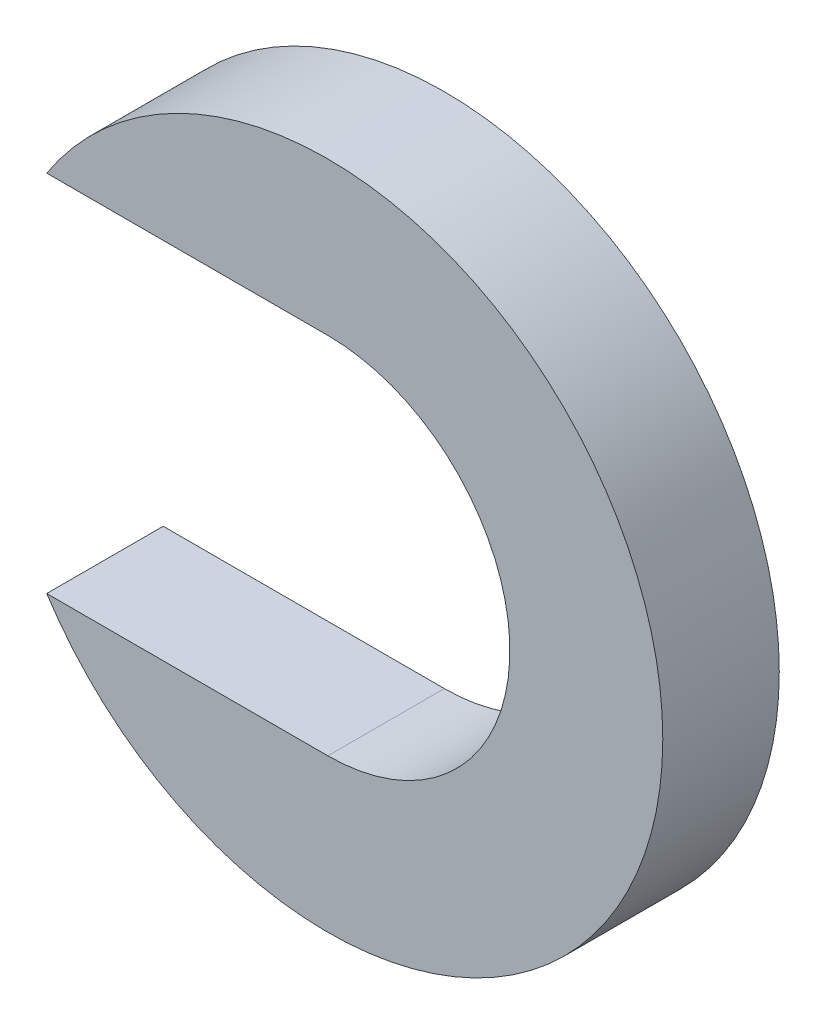
ISO-10303-21;
HEADER;
FILE_DESCRIPTION(('STEP AP214'),'2;1');
FILE_NAME('part.step','',(''),(''),'','','');
FILE_SCHEMA(('AUTOMOTIVE_DESIGN { 1 0 10303 214 1 1 1 1 }'));
ENDSEC;
DATA;
#1=APPLICATION_CONTEXT('core data for automotive mechanical design processes');
#2=APPLICATION_PROTOCOL_DEFINITION('international standard','automotive_design',2000,#1);
#3=PRODUCT_CONTEXT('',#1,'mechanical');
#4=PRODUCT('Part','Part','',(#3));
#5=PRODUCT_RELATED_PRODUCT_CATEGORY('part','',(#4));
#6=PRODUCT_DEFINITION_FORMATION('','',#4);
#7=PRODUCT_DEFINITION_CONTEXT('part definition',#1,'design');
#8=PRODUCT_DEFINITION('design','',#6,#7);
#9=PRODUCT_DEFINITION_SHAPE('','',#8);
#10=(LENGTH_UNIT() NAMED_UNIT(*) SI_UNIT(.MILLI.,.METRE.));
#11=(NAMED_UNIT(*) PLANE_ANGLE_UNIT() SI_UNIT($,.RADIAN.));
#12=(NAMED_UNIT(*) SI_UNIT($,.STERADIAN.) SOLID_ANGLE_UNIT());
#13=UNCERTAINTY_MEASURE_WITH_UNIT(LENGTH_MEASURE(1.E-05),#10,'distance_accuracy_value','');
#14=(GEOMETRIC_REPRESENTATION_CONTEXT(3) GLOBAL_UNCERTAINTY_ASSIGNED_CONTEXT((#13)) GLOBAL_UNIT_ASSIGNED_CONTEXT((#10,
#11,#12)) REPRESENTATION_CONTEXT('',''));
#15=CARTESIAN_POINT('',(0.,0.,0.));
#16=DIRECTION('',(0.,0.,1.));
#17=DIRECTION('',(1.,0.,0.));
#18=AXIS2_PLACEMENT_3D('',#15,#16,#17);
#19=CARTESIAN_POINT('',(0.,0.,3.175));
#20=DIRECTION('',(0.,0.,-1.));
#21=DIRECTION('',(-1.,0.,0.));
#22=AXIS2_PLACEMENT_3D('',#19,#20,#21);
#23=CYLINDRICAL_SURFACE('',#22,9.128125);
#24=CARTESIAN_POINT('',(0.,0.,0.));
#25=DIRECTION('',(0.,0.,1.));
#26=DIRECTION('',(1.,0.,0.));
#27=AXIS2_PLACEMENT_3D('',#24,#25,#26);
#28=CIRCLE('',#27,9.128125);
#29=CARTESIAN_POINT('',(-7.66236028497217,-4.9609375,0.));
#30=VERTEX_POINT('',#29);
#31=CARTESIAN_POINT('',(-7.66236028497217,4.9609375,0.));
#32=VERTEX_POINT('',#31);
#33=EDGE_CURVE('E95',#30,#32,#28,.T.);
#34=ORIENTED_EDGE('',*,*,#33,.T.);
#35=DIRECTION('',(0.,0.,-1.));
#36=VECTOR('',#35,1.);
#37=CARTESIAN_POINT('',(-7.66236028497217,4.9609375,3.175));
#38=LINE('',#37,#36);
#39=CARTESIAN_POINT('',(-7.66236028497217,4.9609375,3.175));
#40=VERTEX_POINT('',#39);
#41=EDGE_CURVE('E11',#40,#32,#38,.T.);
#42=ORIENTED_EDGE('',*,*,#41,.F.);
#43=CARTESIAN_POINT('',(0.,0.,3.175));
#44=DIRECTION('',(0.,0.,1.));
#45=DIRECTION('',(1.,0.,0.));
#46=AXIS2_PLACEMENT_3D('',#43,#44,#45);
#47=CIRCLE('',#46,9.128125);
#48=CARTESIAN_POINT('',(-7.66236028497217,-4.9609375,3.175));
#49=VERTEX_POINT('',#48);
#50=EDGE_CURVE('E83',#49,#40,#47,.T.);
#51=ORIENTED_EDGE('',*,*,#50,.F.);
#52=DIRECTION('',(0.,0.,-1.));
#53=VECTOR('',#52,1.);
#54=CARTESIAN_POINT('',(-7.66236028497217,-4.9609375,3.175));
#55=LINE('',#54,#53);
#56=EDGE_CURVE('E91',#49,#30,#55,.T.);
#57=ORIENTED_EDGE('',*,*,#56,.T.);
#58=EDGE_LOOP('',(#34,#42,#51,#57));
#59=FACE_BOUND('',#58,.T.);
#60=ADVANCED_FACE('F32',(#59),#23,.T.);
#61=CARTESIAN_POINT('',(0.,4.9609375,3.175));
#62=DIRECTION('',(0.,1.,0.));
#63=DIRECTION('',(0.,0.,1.));
#64=AXIS2_PLACEMENT_3D('',#61,#62,#63);
#65=PLANE('',#64);
#66=DIRECTION('',(1.,0.,0.));
#67=VECTOR('',#66,1.);
#68=CARTESIAN_POINT('',(0.,4.9609375,0.));
#69=LINE('',#68,#67);
#70=CARTESIAN_POINT('',(0.,4.9609375,0.));
#71=VERTEX_POINT('',#70);
#72=EDGE_CURVE('E87',#32,#71,#69,.T.);
#73=ORIENTED_EDGE('',*,*,#72,.T.);
#74=DIRECTION('',(0.,0.,-1.));
#75=VECTOR('',#74,1.);
#76=CARTESIAN_POINT('',(0.,4.9609375,3.175));
#77=LINE('',#76,#75);
#78=CARTESIAN_POINT('',(0.,4.9609375,3.175));
#79=VERTEX_POINT('',#78);
#80=EDGE_CURVE('E40',#79,#71,#77,.T.);
#81=ORIENTED_EDGE('',*,*,#80,.F.);
#82=DIRECTION('',(1.,0.,0.));
#83=VECTOR('',#82,1.);
#84=CARTESIAN_POINT('',(0.,4.9609375,3.175));
#85=LINE('',#84,#83);
#86=EDGE_CURVE('E78',#40,#79,#85,.T.);
#87=ORIENTED_EDGE('',*,*,#86,.F.);
#88=ORIENTED_EDGE('',*,*,#41,.T.);
#89=EDGE_LOOP('',(#73,#81,#87,#88));
#90=FACE_BOUND('',#89,.T.);
#91=ADVANCED_FACE('F86',(#90),#65,.F.);
#92=CARTESIAN_POINT('',(0.,0.,3.175));
#93=DIRECTION('',(0.,0.,-1.));
#94=DIRECTION('',(-1.,0.,0.));
#95=AXIS2_PLACEMENT_3D('',#92,#93,#94);
#96=CYLINDRICAL_SURFACE('',#95,4.9609375);
#97=CARTESIAN_POINT('',(0.,0.,0.));
#98=DIRECTION('',(0.,0.,-1.));
#99=DIRECTION('',(1.,0.,0.));
#100=AXIS2_PLACEMENT_3D('',#97,#98,#99);
#101=CIRCLE('',#100,4.9609375);
#102=CARTESIAN_POINT('',(0.,-4.9609375,0.));
#103=VERTEX_POINT('',#102);
#104=EDGE_CURVE('E65',#71,#103,#101,.T.);
#105=ORIENTED_EDGE('',*,*,#104,.T.);
#106=DIRECTION('',(0.,0.,-1.));
#107=VECTOR('',#106,1.);
#108=CARTESIAN_POINT('',(0.,-4.9609375,3.175));
#109=LINE('',#108,#107);
#110=CARTESIAN_POINT('',(0.,-4.9609375,3.175));
#111=VERTEX_POINT('',#110);
#112=EDGE_CURVE('E88',#111,#103,#109,.T.);
#113=ORIENTED_EDGE('',*,*,#112,.F.);
#114=CARTESIAN_POINT('',(0.,0.,3.175));
#115=DIRECTION('',(0.,0.,-1.));
#116=DIRECTION('',(1.,0.,0.));
#117=AXIS2_PLACEMENT_3D('',#114,#115,#116);
#118=CIRCLE('',#117,4.9609375);
#119=EDGE_CURVE('E81',#79,#111,#118,.T.);
#120=ORIENTED_EDGE('',*,*,#119,.F.);
#121=ORIENTED_EDGE('',*,*,#80,.T.);
#122=EDGE_LOOP('',(#105,#113,#120,#121));
#123=FACE_BOUND('',#122,.T.);
#124=ADVANCED_FACE('F89',(#123),#96,.F.);
#125=CARTESIAN_POINT('',(-7.66236028497217,-4.9609375,3.175));
#126=DIRECTION('',(0.,-1.,0.));
#127=DIRECTION('',(1.,0.,0.));
#128=AXIS2_PLACEMENT_3D('',#125,#126,#127);
#129=PLANE('',#128);
#130=DIRECTION('',(-1.,0.,0.));
#131=VECTOR('',#130,1.);
#132=CARTESIAN_POINT('',(-7.66236028497217,-4.9609375,0.));
#133=LINE('',#132,#131);
#134=EDGE_CURVE('E71',#103,#30,#133,.T.);
#135=ORIENTED_EDGE('',*,*,#134,.T.);
#136=ORIENTED_EDGE('',*,*,#56,.F.);
#137=DIRECTION('',(-1.,0.,0.));
#138=VECTOR('',#137,1.);
#139=CARTESIAN_POINT('',(-7.66236028497217,-4.9609375,3.175));
#140=LINE('',#139,#138);
#141=EDGE_CURVE('E48',#111,#49,#140,.T.);
#142=ORIENTED_EDGE('',*,*,#141,.F.);
#143=ORIENTED_EDGE('',*,*,#112,.T.);
#144=EDGE_LOOP('',(#135,#136,#142,#143));
#145=FACE_BOUND('',#144,.T.);
#146=ADVANCED_FACE('F102',(#145),#129,.F.);
#147=CARTESIAN_POINT('',(0.,0.,3.175));
#148=DIRECTION('',(0.,0.,1.));
#149=DIRECTION('',(1.,0.,0.));
#150=AXIS2_PLACEMENT_3D('',#147,#148,#149);
#151=PLANE('',#150);
#152=ORIENTED_EDGE('',*,*,#50,.T.);
#153=ORIENTED_EDGE('',*,*,#86,.T.);
#154=ORIENTED_EDGE('',*,*,#119,.T.);
#155=ORIENTED_EDGE('',*,*,#141,.T.);
#156=EDGE_LOOP('',(#152,#153,#154,#155));
#157=FACE_BOUND('',#156,.T.);
#158=ADVANCED_FACE('F79',(#157),#151,.T.);
#159=CARTESIAN_POINT('',(0.,0.,0.));
#160=DIRECTION('',(0.,0.,1.));
#161=DIRECTION('',(1.,0.,0.));
#162=AXIS2_PLACEMENT_3D('',#159,#160,#161);
#163=PLANE('',#162);
#164=ORIENTED_EDGE('',*,*,#33,.F.);
#165=ORIENTED_EDGE('',*,*,#134,.F.);
#166=ORIENTED_EDGE('',*,*,#104,.F.);
#167=ORIENTED_EDGE('',*,*,#72,.F.);
#168=EDGE_LOOP('',(#164,#165,#166,#167));
#169=FACE_BOUND('',#168,.T.);
#170=ADVANCED_FACE('F105',(#169),#163,.F.);
#171=CLOSED_SHELL('',(#60,#91,#124,#146,#158,#170));
#172=MANIFOLD_SOLID_BREP('B2',#171);
#173=ADVANCED_BREP_SHAPE_REPRESENTATION('',(#18,#172),#14);
#174=SHAPE_DEFINITION_REPRESENTATION(#9,#173);
ENDSEC;
END-ISO-10303-21;
